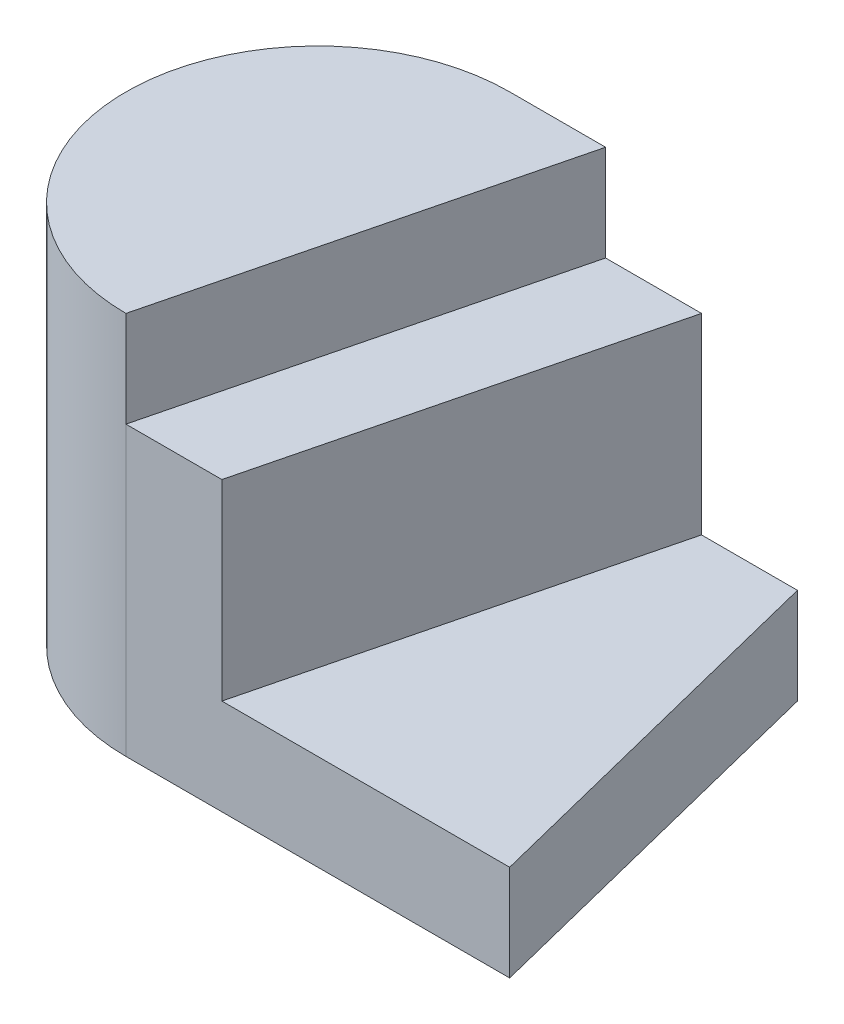
ISO-10303-21;
HEADER;
FILE_DESCRIPTION(('STEP AP214'),'2;1');
FILE_NAME('part.step','',(''),(''),'','','');
FILE_SCHEMA(('AUTOMOTIVE_DESIGN { 1 0 10303 214 1 1 1 1 }'));
ENDSEC;
DATA;
#1=APPLICATION_CONTEXT('core data for automotive mechanical design processes');
#2=APPLICATION_PROTOCOL_DEFINITION('international standard','automotive_design',2000,#1);
#3=PRODUCT_CONTEXT('',#1,'mechanical');
#4=PRODUCT('Part','Part','',(#3));
#5=PRODUCT_RELATED_PRODUCT_CATEGORY('part','',(#4));
#6=PRODUCT_DEFINITION_FORMATION('','',#4);
#7=PRODUCT_DEFINITION_CONTEXT('part definition',#1,'design');
#8=PRODUCT_DEFINITION('design','',#6,#7);
#9=PRODUCT_DEFINITION_SHAPE('','',#8);
#10=(LENGTH_UNIT() NAMED_UNIT(*) SI_UNIT(.MILLI.,.METRE.));
#11=(NAMED_UNIT(*) PLANE_ANGLE_UNIT() SI_UNIT($,.RADIAN.));
#12=(NAMED_UNIT(*) SI_UNIT($,.STERADIAN.) SOLID_ANGLE_UNIT());
#13=UNCERTAINTY_MEASURE_WITH_UNIT(LENGTH_MEASURE(1.E-05),#10,'distance_accuracy_value','');
#14=(GEOMETRIC_REPRESENTATION_CONTEXT(3) GLOBAL_UNCERTAINTY_ASSIGNED_CONTEXT((#13)) GLOBAL_UNIT_ASSIGNED_CONTEXT((#10,
#11,#12)) REPRESENTATION_CONTEXT('',''));
#15=CARTESIAN_POINT('',(0.,0.,0.));
#16=DIRECTION('',(0.,0.,1.));
#17=DIRECTION('',(1.,0.,0.));
#18=AXIS2_PLACEMENT_3D('',#15,#16,#17);
#19=CARTESIAN_POINT('',(2.35294117647059,20.,0.588235294117647));
#20=DIRECTION('',(-0.970142500145332,0.,-0.242535625036333));
#21=DIRECTION('',(-0.242535625036333,0.,0.970142500145332));
#22=AXIS2_PLACEMENT_3D('',#19,#20,#21);
#23=PLANE('',#22);
#24=DIRECTION('',(0.,-1.,0.));
#25=VECTOR('',#24,1.);
#26=CARTESIAN_POINT('',(0.,20.,10.));
#27=LINE('',#26,#25);
#28=CARTESIAN_POINT('',(0.,20.,10.));
#29=VERTEX_POINT('',#28);
#30=CARTESIAN_POINT('',(0.,15.,10.));
#31=VERTEX_POINT('',#30);
#32=EDGE_CURVE('E148',#29,#31,#27,.T.);
#33=ORIENTED_EDGE('',*,*,#32,.T.);
#34=DIRECTION('',(0.242535625036333,0.,-0.970142500145332));
#35=VECTOR('',#34,1.);
#36=CARTESIAN_POINT('',(2.35294117647059,15.,0.588235294117647));
#37=LINE('',#36,#35);
#38=CARTESIAN_POINT('',(5.,15.,-10.));
#39=VERTEX_POINT('',#38);
#40=EDGE_CURVE('E127',#31,#39,#37,.T.);
#41=ORIENTED_EDGE('',*,*,#40,.T.);
#42=DIRECTION('',(0.,-1.,0.));
#43=VECTOR('',#42,1.);
#44=CARTESIAN_POINT('',(5.,20.,-10.));
#45=LINE('',#44,#43);
#46=CARTESIAN_POINT('',(5.,20.,-10.));
#47=VERTEX_POINT('',#46);
#48=EDGE_CURVE('E11',#47,#39,#45,.T.);
#49=ORIENTED_EDGE('',*,*,#48,.F.);
#50=DIRECTION('',(0.242535625036333,0.,-0.970142500145332));
#51=VECTOR('',#50,1.);
#52=CARTESIAN_POINT('',(2.35294117647059,20.,0.588235294117647));
#53=LINE('',#52,#51);
#54=EDGE_CURVE('E140',#29,#47,#53,.T.);
#55=ORIENTED_EDGE('',*,*,#54,.F.);
#56=EDGE_LOOP('',(#33,#41,#49,#55));
#57=FACE_BOUND('',#56,.T.);
#58=ADVANCED_FACE('F33',(#57),#23,.F.);
#59=CARTESIAN_POINT('',(0.,20.,-10.));
#60=DIRECTION('',(0.,0.,-1.));
#61=DIRECTION('',(-1.,0.,0.));
#62=AXIS2_PLACEMENT_3D('',#59,#60,#61);
#63=PLANE('',#62);
#64=DIRECTION('',(1.,0.,0.));
#65=VECTOR('',#64,1.);
#66=CARTESIAN_POINT('',(0.,0.,-10.));
#67=LINE('',#66,#65);
#68=CARTESIAN_POINT('',(0.,0.,-10.));
#69=VERTEX_POINT('',#68);
#70=CARTESIAN_POINT('',(15.,0.,-10.));
#71=VERTEX_POINT('',#70);
#72=EDGE_CURVE('E139',#69,#71,#67,.T.);
#73=ORIENTED_EDGE('',*,*,#72,.F.);
#74=DIRECTION('',(0.,-1.,0.));
#75=VECTOR('',#74,1.);
#76=CARTESIAN_POINT('',(0.,20.,-10.));
#77=LINE('',#76,#75);
#78=CARTESIAN_POINT('',(0.,20.,-10.));
#79=VERTEX_POINT('',#78);
#80=EDGE_CURVE('E40',#79,#69,#77,.T.);
#81=ORIENTED_EDGE('',*,*,#80,.F.);
#82=DIRECTION('',(1.,0.,0.));
#83=VECTOR('',#82,1.);
#84=CARTESIAN_POINT('',(0.,20.,-10.));
#85=LINE('',#84,#83);
#86=EDGE_CURVE('E142',#79,#47,#85,.T.);
#87=ORIENTED_EDGE('',*,*,#86,.T.);
#88=ORIENTED_EDGE('',*,*,#48,.T.);
#89=DIRECTION('',(1.,0.,0.));
#90=VECTOR('',#89,1.);
#91=CARTESIAN_POINT('',(0.,15.,-10.));
#92=LINE('',#91,#90);
#93=CARTESIAN_POINT('',(10.,15.,-10.));
#94=VERTEX_POINT('',#93);
#95=EDGE_CURVE('E125',#39,#94,#92,.T.);
#96=ORIENTED_EDGE('',*,*,#95,.T.);
#97=DIRECTION('',(0.,-1.,0.));
#98=VECTOR('',#97,1.);
#99=CARTESIAN_POINT('',(10.,15.,-10.));
#100=LINE('',#99,#98);
#101=CARTESIAN_POINT('',(10.,5.,-10.));
#102=VERTEX_POINT('',#101);
#103=EDGE_CURVE('E116',#94,#102,#100,.T.);
#104=ORIENTED_EDGE('',*,*,#103,.T.);
#105=DIRECTION('',(1.,0.,0.));
#106=VECTOR('',#105,1.);
#107=CARTESIAN_POINT('',(0.,5.,-10.));
#108=LINE('',#107,#106);
#109=CARTESIAN_POINT('',(15.,5.,-10.));
#110=VERTEX_POINT('',#109);
#111=EDGE_CURVE('E110',#102,#110,#108,.T.);
#112=ORIENTED_EDGE('',*,*,#111,.T.);
#113=DIRECTION('',(0.,-1.,0.));
#114=VECTOR('',#113,1.);
#115=CARTESIAN_POINT('',(15.,5.,-10.));
#116=LINE('',#115,#114);
#117=EDGE_CURVE('E93',#110,#71,#116,.T.);
#118=ORIENTED_EDGE('',*,*,#117,.T.);
#119=EDGE_LOOP('',(#73,#81,#87,#88,#96,#104,#112,#118));
#120=FACE_BOUND('',#119,.T.);
#121=ADVANCED_FACE('F114',(#120),#63,.T.);
#122=CARTESIAN_POINT('',(0.,20.,0.));
#123=DIRECTION('',(0.,-1.,0.));
#124=DIRECTION('',(0.,0.,-1.));
#125=AXIS2_PLACEMENT_3D('',#122,#123,#124);
#126=CYLINDRICAL_SURFACE('',#125,10.);
#127=CARTESIAN_POINT('',(0.,0.,0.));
#128=DIRECTION('',(0.,1.,0.));
#129=DIRECTION('',(0.,0.,1.));
#130=AXIS2_PLACEMENT_3D('',#127,#128,#129);
#131=CIRCLE('',#130,10.);
#132=CARTESIAN_POINT('',(0.,0.,10.));
#133=VERTEX_POINT('',#132);
#134=EDGE_CURVE('E143',#69,#133,#131,.T.);
#135=ORIENTED_EDGE('',*,*,#134,.T.);
#136=DIRECTION('',(0.,-1.,0.));
#137=VECTOR('',#136,1.);
#138=CARTESIAN_POINT('',(0.,15.,10.));
#139=LINE('',#138,#137);
#140=EDGE_CURVE('E135',#31,#133,#139,.T.);
#141=ORIENTED_EDGE('',*,*,#140,.F.);
#142=ORIENTED_EDGE('',*,*,#32,.F.);
#143=CARTESIAN_POINT('',(0.,20.,0.));
#144=DIRECTION('',(0.,1.,0.));
#145=DIRECTION('',(0.,0.,1.));
#146=AXIS2_PLACEMENT_3D('',#143,#144,#145);
#147=CIRCLE('',#146,10.);
#148=EDGE_CURVE('E146',#79,#29,#147,.T.);
#149=ORIENTED_EDGE('',*,*,#148,.F.);
#150=ORIENTED_EDGE('',*,*,#80,.T.);
#151=EDGE_LOOP('',(#135,#141,#142,#149,#150));
#152=FACE_BOUND('',#151,.T.);
#153=ADVANCED_FACE('F155',(#152),#126,.T.);
#154=CARTESIAN_POINT('',(0.,20.,0.));
#155=DIRECTION('',(0.,1.,0.));
#156=DIRECTION('',(0.,0.,1.));
#157=AXIS2_PLACEMENT_3D('',#154,#155,#156);
#158=PLANE('',#157);
#159=ORIENTED_EDGE('',*,*,#54,.T.);
#160=ORIENTED_EDGE('',*,*,#86,.F.);
#161=ORIENTED_EDGE('',*,*,#148,.T.);
#162=EDGE_LOOP('',(#159,#160,#161));
#163=FACE_BOUND('',#162,.T.);
#164=ADVANCED_FACE('F172',(#163),#158,.T.);
#165=CARTESIAN_POINT('',(0.,0.,0.));
#166=DIRECTION('',(0.,1.,0.));
#167=DIRECTION('',(0.,0.,1.));
#168=AXIS2_PLACEMENT_3D('',#165,#166,#167);
#169=PLANE('',#168);
#170=ORIENTED_EDGE('',*,*,#72,.T.);
#171=DIRECTION('',(0.242535625036333,0.,0.970142500145332));
#172=VECTOR('',#171,1.);
#173=CARTESIAN_POINT('',(16.4705882352941,0.,-4.11764705882353));
#174=LINE('',#173,#172);
#175=CARTESIAN_POINT('',(20.,0.,10.));
#176=VERTEX_POINT('',#175);
#177=EDGE_CURVE('E100',#71,#176,#174,.T.);
#178=ORIENTED_EDGE('',*,*,#177,.T.);
#179=DIRECTION('',(-1.,0.,0.));
#180=VECTOR('',#179,1.);
#181=CARTESIAN_POINT('',(0.,0.,10.));
#182=LINE('',#181,#180);
#183=EDGE_CURVE('E104',#176,#133,#182,.T.);
#184=ORIENTED_EDGE('',*,*,#183,.T.);
#185=ORIENTED_EDGE('',*,*,#134,.F.);
#186=EDGE_LOOP('',(#170,#178,#184,#185));
#187=FACE_BOUND('',#186,.T.);
#188=ADVANCED_FACE('F159',(#187),#169,.F.);
#189=CARTESIAN_POINT('',(7.05882352941176,15.,1.76470588235294));
#190=DIRECTION('',(0.970142500145332,0.,0.242535625036333));
#191=DIRECTION('',(0.242535625036333,0.,-0.970142500145332));
#192=AXIS2_PLACEMENT_3D('',#189,#190,#191);
#193=PLANE('',#192);
#194=DIRECTION('',(-0.242535625036333,0.,0.970142500145332));
#195=VECTOR('',#194,1.);
#196=CARTESIAN_POINT('',(7.05882352941176,5.,1.76470588235294));
#197=LINE('',#196,#195);
#198=CARTESIAN_POINT('',(5.,5.,10.));
#199=VERTEX_POINT('',#198);
#200=EDGE_CURVE('E47',#102,#199,#197,.T.);
#201=ORIENTED_EDGE('',*,*,#200,.F.);
#202=ORIENTED_EDGE('',*,*,#103,.F.);
#203=DIRECTION('',(-0.242535625036333,0.,0.970142500145332));
#204=VECTOR('',#203,1.);
#205=CARTESIAN_POINT('',(7.05882352941176,15.,1.76470588235294));
#206=LINE('',#205,#204);
#207=CARTESIAN_POINT('',(5.,15.,10.));
#208=VERTEX_POINT('',#207);
#209=EDGE_CURVE('E123',#94,#208,#206,.T.);
#210=ORIENTED_EDGE('',*,*,#209,.T.);
#211=DIRECTION('',(0.,-1.,0.));
#212=VECTOR('',#211,1.);
#213=CARTESIAN_POINT('',(5.,15.,10.));
#214=LINE('',#213,#212);
#215=EDGE_CURVE('E52',#208,#199,#214,.T.);
#216=ORIENTED_EDGE('',*,*,#215,.T.);
#217=EDGE_LOOP('',(#201,#202,#210,#216));
#218=FACE_BOUND('',#217,.T.);
#219=ADVANCED_FACE('F179',(#218),#193,.T.);
#220=CARTESIAN_POINT('',(0.,15.,10.));
#221=DIRECTION('',(0.,0.,1.));
#222=DIRECTION('',(1.,0.,0.));
#223=AXIS2_PLACEMENT_3D('',#220,#221,#222);
#224=PLANE('',#223);
#225=ORIENTED_EDGE('',*,*,#183,.F.);
#226=DIRECTION('',(0.,-1.,0.));
#227=VECTOR('',#226,1.);
#228=CARTESIAN_POINT('',(20.,5.,10.));
#229=LINE('',#228,#227);
#230=CARTESIAN_POINT('',(20.,5.,10.));
#231=VERTEX_POINT('',#230);
#232=EDGE_CURVE('E105',#231,#176,#229,.T.);
#233=ORIENTED_EDGE('',*,*,#232,.F.);
#234=DIRECTION('',(-1.,0.,0.));
#235=VECTOR('',#234,1.);
#236=CARTESIAN_POINT('',(0.,5.,10.));
#237=LINE('',#236,#235);
#238=EDGE_CURVE('E112',#231,#199,#237,.T.);
#239=ORIENTED_EDGE('',*,*,#238,.T.);
#240=ORIENTED_EDGE('',*,*,#215,.F.);
#241=DIRECTION('',(-1.,0.,0.));
#242=VECTOR('',#241,1.);
#243=CARTESIAN_POINT('',(0.,15.,10.));
#244=LINE('',#243,#242);
#245=EDGE_CURVE('E129',#208,#31,#244,.T.);
#246=ORIENTED_EDGE('',*,*,#245,.T.);
#247=ORIENTED_EDGE('',*,*,#140,.T.);
#248=EDGE_LOOP('',(#225,#233,#239,#240,#246,#247));
#249=FACE_BOUND('',#248,.T.);
#250=ADVANCED_FACE('F161',(#249),#224,.T.);
#251=CARTESIAN_POINT('',(0.,15.,0.));
#252=DIRECTION('',(0.,1.,0.));
#253=DIRECTION('',(0.,0.,1.));
#254=AXIS2_PLACEMENT_3D('',#251,#252,#253);
#255=PLANE('',#254);
#256=ORIENTED_EDGE('',*,*,#209,.F.);
#257=ORIENTED_EDGE('',*,*,#95,.F.);
#258=ORIENTED_EDGE('',*,*,#40,.F.);
#259=ORIENTED_EDGE('',*,*,#245,.F.);
#260=EDGE_LOOP('',(#256,#257,#258,#259));
#261=FACE_BOUND('',#260,.T.);
#262=ADVANCED_FACE('F170',(#261),#255,.T.);
#263=CARTESIAN_POINT('',(16.4705882352941,5.,-4.11764705882353));
#264=DIRECTION('',(0.970142500145332,0.,-0.242535625036333));
#265=DIRECTION('',(-0.242535625036333,0.,-0.970142500145332));
#266=AXIS2_PLACEMENT_3D('',#263,#264,#265);
#267=PLANE('',#266);
#268=ORIENTED_EDGE('',*,*,#177,.F.);
#269=ORIENTED_EDGE('',*,*,#117,.F.);
#270=DIRECTION('',(0.242535625036333,0.,0.970142500145332));
#271=VECTOR('',#270,1.);
#272=CARTESIAN_POINT('',(16.4705882352941,5.,-4.11764705882353));
#273=LINE('',#272,#271);
#274=EDGE_CURVE('E97',#110,#231,#273,.T.);
#275=ORIENTED_EDGE('',*,*,#274,.T.);
#276=ORIENTED_EDGE('',*,*,#232,.T.);
#277=EDGE_LOOP('',(#268,#269,#275,#276));
#278=FACE_BOUND('',#277,.T.);
#279=ADVANCED_FACE('F95',(#278),#267,.T.);
#280=CARTESIAN_POINT('',(0.,5.,0.));
#281=DIRECTION('',(0.,1.,0.));
#282=DIRECTION('',(0.,0.,1.));
#283=AXIS2_PLACEMENT_3D('',#280,#281,#282);
#284=PLANE('',#283);
#285=ORIENTED_EDGE('',*,*,#274,.F.);
#286=ORIENTED_EDGE('',*,*,#111,.F.);
#287=ORIENTED_EDGE('',*,*,#200,.T.);
#288=ORIENTED_EDGE('',*,*,#238,.F.);
#289=EDGE_LOOP('',(#285,#286,#287,#288));
#290=FACE_BOUND('',#289,.T.);
#291=ADVANCED_FACE('F109',(#290),#284,.T.);
#292=CLOSED_SHELL('',(#58,#121,#153,#164,#188,#219,#250,#262,#279,#291));
#293=MANIFOLD_SOLID_BREP('B2',#292);
#294=ADVANCED_BREP_SHAPE_REPRESENTATION('',(#18,#293),#14);
#295=SHAPE_DEFINITION_REPRESENTATION(#9,#294);
ENDSEC;
END-ISO-10303-21;
